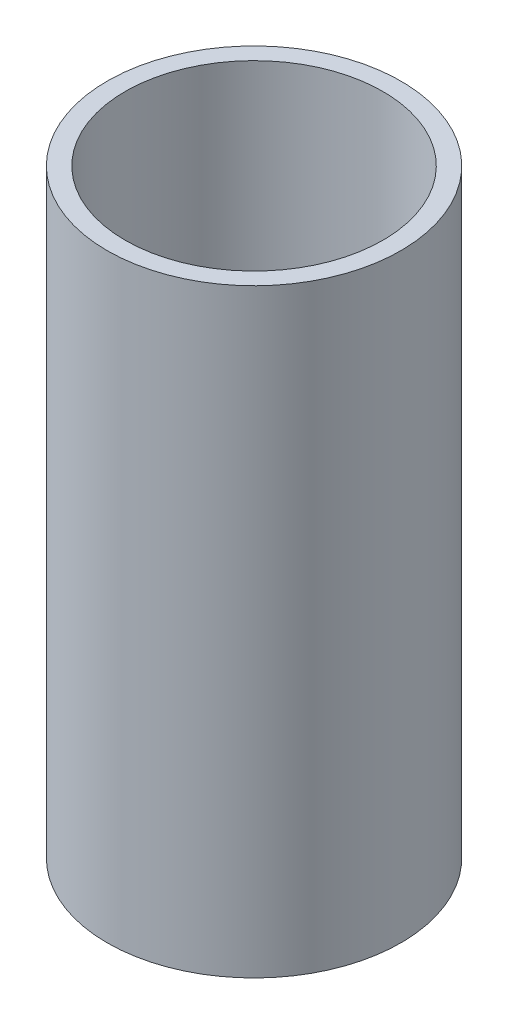
ISO-10303-21;
HEADER;
FILE_DESCRIPTION(('STEP AP214'),'2;1');
FILE_NAME('part.step','',(''),(''),'','','');
FILE_SCHEMA(('AUTOMOTIVE_DESIGN { 1 0 10303 214 1 1 1 1 }'));
ENDSEC;
DATA;
#1=APPLICATION_CONTEXT('core data for automotive mechanical design processes');
#2=APPLICATION_PROTOCOL_DEFINITION('international standard','automotive_design',2000,#1);
#3=PRODUCT_CONTEXT('',#1,'mechanical');
#4=PRODUCT('Part','Part','',(#3));
#5=PRODUCT_RELATED_PRODUCT_CATEGORY('part','',(#4));
#6=PRODUCT_DEFINITION_FORMATION('','',#4);
#7=PRODUCT_DEFINITION_CONTEXT('part definition',#1,'design');
#8=PRODUCT_DEFINITION('design','',#6,#7);
#9=PRODUCT_DEFINITION_SHAPE('','',#8);
#10=(LENGTH_UNIT() NAMED_UNIT(*) SI_UNIT(.MILLI.,.METRE.));
#11=(NAMED_UNIT(*) PLANE_ANGLE_UNIT() SI_UNIT($,.RADIAN.));
#12=(NAMED_UNIT(*) SI_UNIT($,.STERADIAN.) SOLID_ANGLE_UNIT());
#13=UNCERTAINTY_MEASURE_WITH_UNIT(LENGTH_MEASURE(1.E-05),#10,'distance_accuracy_value','');
#14=(GEOMETRIC_REPRESENTATION_CONTEXT(3) GLOBAL_UNCERTAINTY_ASSIGNED_CONTEXT((#13)) GLOBAL_UNIT_ASSIGNED_CONTEXT((#10,
#11,#12)) REPRESENTATION_CONTEXT('',''));
#15=CARTESIAN_POINT('',(0.,0.,0.));
#16=DIRECTION('',(0.,0.,1.));
#17=DIRECTION('',(1.,0.,0.));
#18=AXIS2_PLACEMENT_3D('',#15,#16,#17);
#19=CARTESIAN_POINT('',(0.,-20.,0.));
#20=DIRECTION('',(0.,1.,0.));
#21=DIRECTION('',(0.,0.,1.));
#22=AXIS2_PLACEMENT_3D('',#19,#20,#21);
#23=CYLINDRICAL_SURFACE('',#22,4.9);
#24=CARTESIAN_POINT('',(0.,-20.,0.));
#25=DIRECTION('',(0.,1.,0.));
#26=DIRECTION('',(0.,0.,1.));
#27=AXIS2_PLACEMENT_3D('',#24,#25,#26);
#28=CIRCLE('',#27,4.9);
#29=CARTESIAN_POINT('',(0.,-20.,4.9));
#30=VERTEX_POINT('',#29);
#31=EDGE_CURVE('E10',#30,#30,#28,.T.);
#32=ORIENTED_EDGE('',*,*,#31,.T.);
#33=EDGE_LOOP('',(#32));
#34=FACE_BOUND('',#33,.T.);
#35=CARTESIAN_POINT('',(0.,0.,0.));
#36=DIRECTION('',(0.,1.,0.));
#37=DIRECTION('',(0.,0.,1.));
#38=AXIS2_PLACEMENT_3D('',#35,#36,#37);
#39=CIRCLE('',#38,4.9);
#40=CARTESIAN_POINT('',(0.,0.,4.9));
#41=VERTEX_POINT('',#40);
#42=EDGE_CURVE('E38',#41,#41,#39,.T.);
#43=ORIENTED_EDGE('',*,*,#42,.F.);
#44=EDGE_LOOP('',(#43));
#45=FACE_BOUND('',#44,.T.);
#46=ADVANCED_FACE('F35',(#34,#45),#23,.T.);
#47=CARTESIAN_POINT('',(0.,-20.,0.));
#48=DIRECTION('',(0.,1.,0.));
#49=DIRECTION('',(0.,0.,1.));
#50=AXIS2_PLACEMENT_3D('',#47,#48,#49);
#51=PLANE('',#50);
#52=ORIENTED_EDGE('',*,*,#31,.F.);
#53=EDGE_LOOP('',(#52));
#54=FACE_BOUND('',#53,.T.);
#55=ADVANCED_FACE('F64',(#54),#51,.F.);
#56=CARTESIAN_POINT('',(0.,0.,0.));
#57=DIRECTION('',(0.,1.,0.));
#58=DIRECTION('',(0.,0.,1.));
#59=AXIS2_PLACEMENT_3D('',#56,#57,#58);
#60=PLANE('',#59);
#61=CARTESIAN_POINT('',(0.,0.,0.));
#62=DIRECTION('',(0.,1.,0.));
#63=DIRECTION('',(0.,0.,1.));
#64=AXIS2_PLACEMENT_3D('',#61,#62,#63);
#65=CIRCLE('',#64,4.3);
#66=CARTESIAN_POINT('',(0.,0.,4.3));
#67=VERTEX_POINT('',#66);
#68=EDGE_CURVE('E47',#67,#67,#65,.T.);
#69=ORIENTED_EDGE('',*,*,#68,.F.);
#70=EDGE_LOOP('',(#69));
#71=FACE_BOUND('',#70,.T.);
#72=ORIENTED_EDGE('',*,*,#42,.T.);
#73=EDGE_LOOP('',(#72));
#74=FACE_BOUND('',#73,.T.);
#75=ADVANCED_FACE('F58',(#71,#74),#60,.T.);
#76=CARTESIAN_POINT('',(0.,-19.5,0.));
#77=DIRECTION('',(0.,1.,0.));
#78=DIRECTION('',(0.,0.,1.));
#79=AXIS2_PLACEMENT_3D('',#76,#77,#78);
#80=CYLINDRICAL_SURFACE('',#79,4.3);
#81=CARTESIAN_POINT('',(0.,-19.5,0.));
#82=DIRECTION('',(0.,1.,0.));
#83=DIRECTION('',(0.,0.,1.));
#84=AXIS2_PLACEMENT_3D('',#81,#82,#83);
#85=CIRCLE('',#84,4.3);
#86=CARTESIAN_POINT('',(0.,-19.5,4.3));
#87=VERTEX_POINT('',#86);
#88=EDGE_CURVE('E45',#87,#87,#85,.T.);
#89=ORIENTED_EDGE('',*,*,#88,.F.);
#90=EDGE_LOOP('',(#89));
#91=FACE_BOUND('',#90,.T.);
#92=ORIENTED_EDGE('',*,*,#68,.T.);
#93=EDGE_LOOP('',(#92));
#94=FACE_BOUND('',#93,.T.);
#95=ADVANCED_FACE('F55',(#91,#94),#80,.F.);
#96=CARTESIAN_POINT('',(0.,-19.5,0.));
#97=DIRECTION('',(0.,1.,0.));
#98=DIRECTION('',(0.,0.,1.));
#99=AXIS2_PLACEMENT_3D('',#96,#97,#98);
#100=PLANE('',#99);
#101=ORIENTED_EDGE('',*,*,#88,.T.);
#102=EDGE_LOOP('',(#101));
#103=FACE_BOUND('',#102,.T.);
#104=ADVANCED_FACE('F53',(#103),#100,.T.);
#105=CLOSED_SHELL('',(#46,#55,#75,#95,#104));
#106=MANIFOLD_SOLID_BREP('B2',#105);
#107=ADVANCED_BREP_SHAPE_REPRESENTATION('',(#18,#106),#14);
#108=SHAPE_DEFINITION_REPRESENTATION(#9,#107);
ENDSEC;
END-ISO-10303-21;
